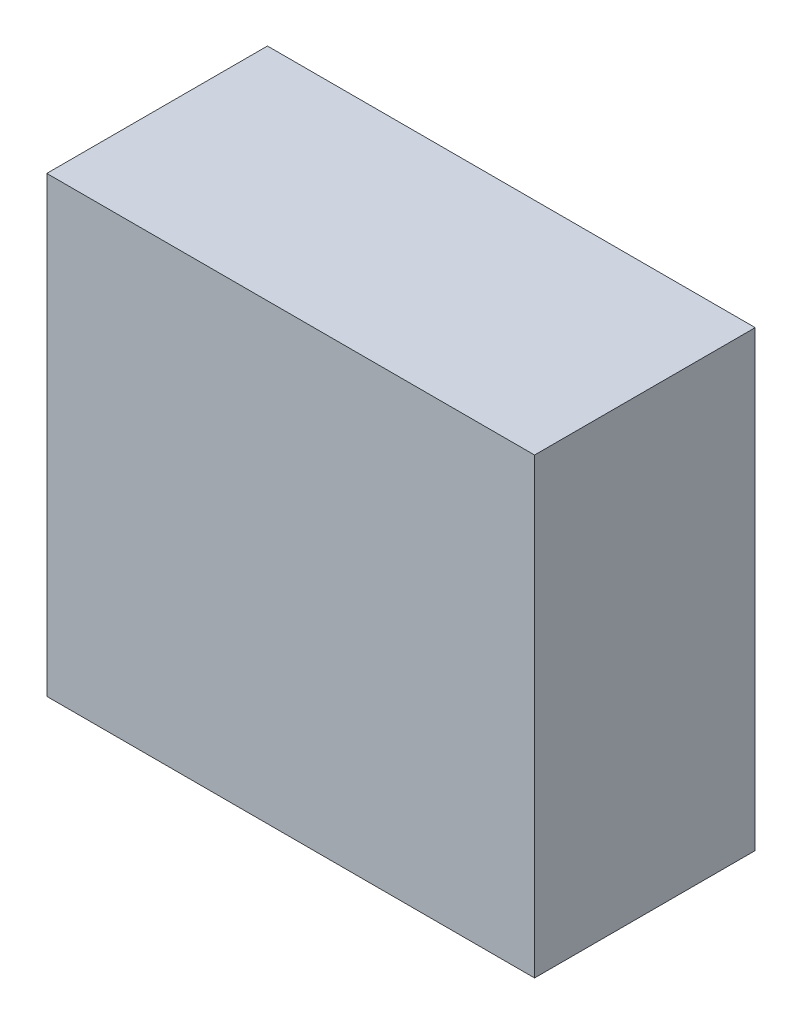
ISO-10303-21;
HEADER;
FILE_DESCRIPTION(('STEP AP214'),'2;1');
FILE_NAME('part.step','',(''),(''),'','','');
FILE_SCHEMA(('AUTOMOTIVE_DESIGN { 1 0 10303 214 1 1 1 1 }'));
ENDSEC;
DATA;
#1=APPLICATION_CONTEXT('core data for automotive mechanical design processes');
#2=APPLICATION_PROTOCOL_DEFINITION('international standard','automotive_design',2000,#1);
#3=PRODUCT_CONTEXT('',#1,'mechanical');
#4=PRODUCT('Part','Part','',(#3));
#5=PRODUCT_RELATED_PRODUCT_CATEGORY('part','',(#4));
#6=PRODUCT_DEFINITION_FORMATION('','',#4);
#7=PRODUCT_DEFINITION_CONTEXT('part definition',#1,'design');
#8=PRODUCT_DEFINITION('design','',#6,#7);
#9=PRODUCT_DEFINITION_SHAPE('','',#8);
#10=(LENGTH_UNIT() NAMED_UNIT(*) SI_UNIT(.MILLI.,.METRE.));
#11=(NAMED_UNIT(*) PLANE_ANGLE_UNIT() SI_UNIT($,.RADIAN.));
#12=(NAMED_UNIT(*) SI_UNIT($,.STERADIAN.) SOLID_ANGLE_UNIT());
#13=UNCERTAINTY_MEASURE_WITH_UNIT(LENGTH_MEASURE(1.E-05),#10,'distance_accuracy_value','');
#14=(GEOMETRIC_REPRESENTATION_CONTEXT(3) GLOBAL_UNCERTAINTY_ASSIGNED_CONTEXT((#13)) GLOBAL_UNIT_ASSIGNED_CONTEXT((#10,
#11,#12)) REPRESENTATION_CONTEXT('',''));
#15=CARTESIAN_POINT('',(0.,0.,0.));
#16=DIRECTION('',(0.,0.,1.));
#17=DIRECTION('',(1.,0.,0.));
#18=AXIS2_PLACEMENT_3D('',#15,#16,#17);
#19=CARTESIAN_POINT('',(22.922717540733,3.947980609798,-26.93448402181));
#20=DIRECTION('',(0.,0.,1.));
#21=DIRECTION('',(1.,0.,0.));
#22=AXIS2_PLACEMENT_3D('',#19,#20,#21);
#23=PLANE('',#22);
#24=DIRECTION('',(1.,0.,0.));
#25=VECTOR('',#24,1.);
#26=CARTESIAN_POINT('',(22.922717540733,11.747980609798,-26.93448402181));
#27=LINE('',#26,#25);
#28=CARTESIAN_POINT('',(22.922717540733,11.747980609798,-26.93448402181));
#29=VERTEX_POINT('',#28);
#30=CARTESIAN_POINT('',(31.322717540733,11.747980609798,-26.93448402181));
#31=VERTEX_POINT('',#30);
#32=EDGE_CURVE('E81',#29,#31,#27,.T.);
#33=ORIENTED_EDGE('',*,*,#32,.T.);
#34=DIRECTION('',(0.,-1.,0.));
#35=VECTOR('',#34,1.);
#36=CARTESIAN_POINT('',(31.322717540733,11.747980609798,-26.93448402181));
#37=LINE('',#36,#35);
#38=CARTESIAN_POINT('',(31.322717540733,3.947980609798,-26.93448402181));
#39=VERTEX_POINT('',#38);
#40=EDGE_CURVE('E68',#31,#39,#37,.T.);
#41=ORIENTED_EDGE('',*,*,#40,.T.);
#42=DIRECTION('',(1.,0.,0.));
#43=VECTOR('',#42,1.);
#44=CARTESIAN_POINT('',(22.922717540733,3.947980609798,-26.93448402181));
#45=LINE('',#44,#43);
#46=CARTESIAN_POINT('',(22.922717540733,3.947980609798,-26.93448402181));
#47=VERTEX_POINT('',#46);
#48=EDGE_CURVE('E55',#39,#47,#45,.F.);
#49=ORIENTED_EDGE('',*,*,#48,.T.);
#50=DIRECTION('',(0.,1.,0.));
#51=VECTOR('',#50,1.);
#52=CARTESIAN_POINT('',(22.922717540733,11.747980609798,-26.93448402181));
#53=LINE('',#52,#51);
#54=EDGE_CURVE('E20',#47,#29,#53,.T.);
#55=ORIENTED_EDGE('',*,*,#54,.T.);
#56=EDGE_LOOP('',(#33,#41,#49,#55));
#57=FACE_BOUND('',#56,.T.);
#58=ADVANCED_FACE('F17',(#57),#23,.F.);
#59=CARTESIAN_POINT('',(22.922717540733,11.747980609798,-23.13448402181));
#60=DIRECTION('',(1.,0.,0.));
#61=DIRECTION('',(0.,1.,0.));
#62=AXIS2_PLACEMENT_3D('',#59,#60,#61);
#63=PLANE('',#62);
#64=DIRECTION('',(0.,0.,1.));
#65=VECTOR('',#64,1.);
#66=CARTESIAN_POINT('',(22.922717540733,3.947980609798,-23.13448402181));
#67=LINE('',#66,#65);
#68=CARTESIAN_POINT('',(22.922717540733,3.947980609798,-23.13448402181));
#69=VERTEX_POINT('',#68);
#70=EDGE_CURVE('E61',#47,#69,#67,.T.);
#71=ORIENTED_EDGE('',*,*,#70,.T.);
#72=DIRECTION('',(0.,1.,0.));
#73=VECTOR('',#72,1.);
#74=CARTESIAN_POINT('',(22.922717540733,3.947980609798,-23.13448402181));
#75=LINE('',#74,#73);
#76=CARTESIAN_POINT('',(22.922717540733,11.747980609798,-23.13448402181));
#77=VERTEX_POINT('',#76);
#78=EDGE_CURVE('E83',#77,#69,#75,.F.);
#79=ORIENTED_EDGE('',*,*,#78,.F.);
#80=DIRECTION('',(0.,0.,-1.));
#81=VECTOR('',#80,1.);
#82=CARTESIAN_POINT('',(22.922717540733,11.747980609798,-23.13448402181));
#83=LINE('',#82,#81);
#84=EDGE_CURVE('E64',#77,#29,#83,.T.);
#85=ORIENTED_EDGE('',*,*,#84,.T.);
#86=ORIENTED_EDGE('',*,*,#54,.F.);
#87=EDGE_LOOP('',(#71,#79,#85,#86));
#88=FACE_BOUND('',#87,.T.);
#89=ADVANCED_FACE('F60',(#88),#63,.F.);
#90=CARTESIAN_POINT('',(22.922717540733,3.947980609798,-23.13448402181));
#91=DIRECTION('',(0.,1.,0.));
#92=DIRECTION('',(0.,0.,1.));
#93=AXIS2_PLACEMENT_3D('',#90,#91,#92);
#94=PLANE('',#93);
#95=DIRECTION('',(0.,0.,1.));
#96=VECTOR('',#95,1.);
#97=CARTESIAN_POINT('',(31.322717540733,3.947980609798,-23.13448402181));
#98=LINE('',#97,#96);
#99=CARTESIAN_POINT('',(31.322717540733,3.947980609798,-23.13448402181));
#100=VERTEX_POINT('',#99);
#101=EDGE_CURVE('E70',#39,#100,#98,.T.);
#102=ORIENTED_EDGE('',*,*,#101,.T.);
#103=DIRECTION('',(1.,0.,0.));
#104=VECTOR('',#103,1.);
#105=CARTESIAN_POINT('',(22.922717540733,3.947980609798,-23.13448402181));
#106=LINE('',#105,#104);
#107=EDGE_CURVE('E74',#69,#100,#106,.T.);
#108=ORIENTED_EDGE('',*,*,#107,.F.);
#109=ORIENTED_EDGE('',*,*,#70,.F.);
#110=ORIENTED_EDGE('',*,*,#48,.F.);
#111=EDGE_LOOP('',(#102,#108,#109,#110));
#112=FACE_BOUND('',#111,.T.);
#113=ADVANCED_FACE('F72',(#112),#94,.F.);
#114=CARTESIAN_POINT('',(31.322717540733,11.747980609798,-23.13448402181));
#115=DIRECTION('',(-1.,0.,0.));
#116=DIRECTION('',(0.,-1.,0.));
#117=AXIS2_PLACEMENT_3D('',#114,#115,#116);
#118=PLANE('',#117);
#119=DIRECTION('',(0.,0.,-1.));
#120=VECTOR('',#119,1.);
#121=CARTESIAN_POINT('',(31.322717540733,11.747980609798,-23.13448402181));
#122=LINE('',#121,#120);
#123=CARTESIAN_POINT('',(31.322717540733,11.747980609798,-23.13448402181));
#124=VERTEX_POINT('',#123);
#125=EDGE_CURVE('E35',#31,#124,#122,.F.);
#126=ORIENTED_EDGE('',*,*,#125,.T.);
#127=DIRECTION('',(0.,1.,0.));
#128=VECTOR('',#127,1.);
#129=CARTESIAN_POINT('',(31.322717540733,3.947980609798,-23.13448402181));
#130=LINE('',#129,#128);
#131=EDGE_CURVE('E26',#100,#124,#130,.T.);
#132=ORIENTED_EDGE('',*,*,#131,.F.);
#133=ORIENTED_EDGE('',*,*,#101,.F.);
#134=ORIENTED_EDGE('',*,*,#40,.F.);
#135=EDGE_LOOP('',(#126,#132,#133,#134));
#136=FACE_BOUND('',#135,.T.);
#137=ADVANCED_FACE('F89',(#136),#118,.F.);
#138=CARTESIAN_POINT('',(22.922717540733,11.747980609798,-23.13448402181));
#139=DIRECTION('',(0.,-1.,0.));
#140=DIRECTION('',(0.,0.,-1.));
#141=AXIS2_PLACEMENT_3D('',#138,#139,#140);
#142=PLANE('',#141);
#143=ORIENTED_EDGE('',*,*,#84,.F.);
#144=DIRECTION('',(1.,0.,0.));
#145=VECTOR('',#144,1.);
#146=CARTESIAN_POINT('',(22.922717540733,11.747980609798,-23.13448402181));
#147=LINE('',#146,#145);
#148=EDGE_CURVE('E11',#124,#77,#147,.F.);
#149=ORIENTED_EDGE('',*,*,#148,.F.);
#150=ORIENTED_EDGE('',*,*,#125,.F.);
#151=ORIENTED_EDGE('',*,*,#32,.F.);
#152=EDGE_LOOP('',(#143,#149,#150,#151));
#153=FACE_BOUND('',#152,.T.);
#154=ADVANCED_FACE('F91',(#153),#142,.F.);
#155=CARTESIAN_POINT('',(22.922717540733,3.947980609798,-23.13448402181));
#156=DIRECTION('',(0.,0.,1.));
#157=DIRECTION('',(1.,0.,0.));
#158=AXIS2_PLACEMENT_3D('',#155,#156,#157);
#159=PLANE('',#158);
#160=ORIENTED_EDGE('',*,*,#131,.T.);
#161=ORIENTED_EDGE('',*,*,#148,.T.);
#162=ORIENTED_EDGE('',*,*,#78,.T.);
#163=ORIENTED_EDGE('',*,*,#107,.T.);
#164=EDGE_LOOP('',(#160,#161,#162,#163));
#165=FACE_BOUND('',#164,.T.);
#166=ADVANCED_FACE('F88',(#165),#159,.T.);
#167=CLOSED_SHELL('',(#58,#89,#113,#137,#154,#166));
#168=MANIFOLD_SOLID_BREP('B1',#167);
#169=ADVANCED_BREP_SHAPE_REPRESENTATION('',(#18,#168),#14);
#170=SHAPE_DEFINITION_REPRESENTATION(#9,#169);
ENDSEC;
END-ISO-10303-21;
